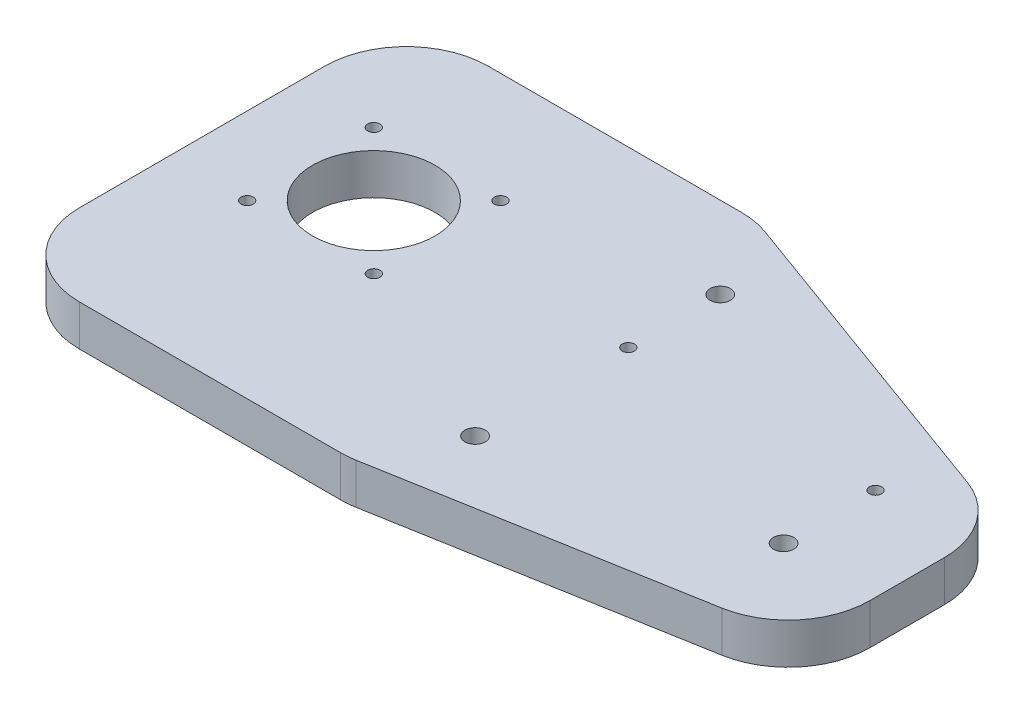
ISO-10303-21;
HEADER;
FILE_DESCRIPTION(('STEP AP214'),'2;1');
FILE_NAME('part.step','',(''),(''),'','','');
FILE_SCHEMA(('AUTOMOTIVE_DESIGN { 1 0 10303 214 1 1 1 1 }'));
ENDSEC;
DATA;
#1=APPLICATION_CONTEXT('core data for automotive mechanical design processes');
#2=APPLICATION_PROTOCOL_DEFINITION('international standard','automotive_design',2000,#1);
#3=PRODUCT_CONTEXT('',#1,'mechanical');
#4=PRODUCT('Part','Part','',(#3));
#5=PRODUCT_RELATED_PRODUCT_CATEGORY('part','',(#4));
#6=PRODUCT_DEFINITION_FORMATION('','',#4);
#7=PRODUCT_DEFINITION_CONTEXT('part definition',#1,'design');
#8=PRODUCT_DEFINITION('design','',#6,#7);
#9=PRODUCT_DEFINITION_SHAPE('','',#8);
#10=(LENGTH_UNIT() NAMED_UNIT(*) SI_UNIT(.MILLI.,.METRE.));
#11=(NAMED_UNIT(*) PLANE_ANGLE_UNIT() SI_UNIT($,.RADIAN.));
#12=(NAMED_UNIT(*) SI_UNIT($,.STERADIAN.) SOLID_ANGLE_UNIT());
#13=UNCERTAINTY_MEASURE_WITH_UNIT(LENGTH_MEASURE(1.E-05),#10,'distance_accuracy_value','');
#14=(GEOMETRIC_REPRESENTATION_CONTEXT(3) GLOBAL_UNCERTAINTY_ASSIGNED_CONTEXT((#13)) GLOBAL_UNIT_ASSIGNED_CONTEXT((#10,
#11,#12)) REPRESENTATION_CONTEXT('',''));
#15=CARTESIAN_POINT('',(0.,0.,0.));
#16=DIRECTION('',(0.,0.,1.));
#17=DIRECTION('',(1.,0.,0.));
#18=AXIS2_PLACEMENT_3D('',#15,#16,#17);
#19=CARTESIAN_POINT('',(20.,10.,-80.));
#20=DIRECTION('',(0.,-1.,0.));
#21=DIRECTION('',(0.,0.,-1.));
#22=AXIS2_PLACEMENT_3D('',#19,#20,#21);
#23=CYLINDRICAL_SURFACE('',#22,20.);
#24=CARTESIAN_POINT('',(20.,0.,-80.));
#25=DIRECTION('',(0.,1.,0.));
#26=DIRECTION('',(0.,0.,1.));
#27=AXIS2_PLACEMENT_3D('',#24,#25,#26);
#28=CIRCLE('',#27,20.);
#29=CARTESIAN_POINT('',(0.,0.,-79.9999999999999));
#30=VERTEX_POINT('',#29);
#31=CARTESIAN_POINT('',(20.0000000000001,0.,-100.));
#32=VERTEX_POINT('',#31);
#33=EDGE_CURVE('E184',#30,#32,#28,.F.);
#34=ORIENTED_EDGE('',*,*,#33,.F.);
#35=DIRECTION('',(0.,-1.,0.));
#36=VECTOR('',#35,1.);
#37=CARTESIAN_POINT('',(0.,10.,-79.9999999999999));
#38=LINE('',#37,#36);
#39=CARTESIAN_POINT('',(0.,10.,-79.9999999999999));
#40=VERTEX_POINT('',#39);
#41=EDGE_CURVE('E11',#40,#30,#38,.T.);
#42=ORIENTED_EDGE('',*,*,#41,.F.);
#43=CARTESIAN_POINT('',(20.,10.,-80.));
#44=DIRECTION('',(0.,1.,0.));
#45=DIRECTION('',(0.,0.,1.));
#46=AXIS2_PLACEMENT_3D('',#43,#44,#45);
#47=CIRCLE('',#46,20.);
#48=CARTESIAN_POINT('',(20.0000000000001,10.,-100.));
#49=VERTEX_POINT('',#48);
#50=EDGE_CURVE('E395',#40,#49,#47,.F.);
#51=ORIENTED_EDGE('',*,*,#50,.T.);
#52=DIRECTION('',(0.,-1.,0.));
#53=VECTOR('',#52,1.);
#54=CARTESIAN_POINT('',(20.0000000000001,10.,-100.));
#55=LINE('',#54,#53);
#56=EDGE_CURVE('E52',#49,#32,#55,.T.);
#57=ORIENTED_EDGE('',*,*,#56,.T.);
#58=EDGE_LOOP('',(#34,#42,#51,#57));
#59=FACE_BOUND('',#58,.T.);
#60=ADVANCED_FACE('F35',(#59),#23,.T.);
#61=CARTESIAN_POINT('',(0.,10.,0.));
#62=DIRECTION('',(-1.,0.,0.));
#63=DIRECTION('',(0.,0.,1.));
#64=AXIS2_PLACEMENT_3D('',#61,#62,#63);
#65=PLANE('',#64);
#66=DIRECTION('',(0.,0.,-1.));
#67=VECTOR('',#66,1.);
#68=CARTESIAN_POINT('',(0.,0.,0.));
#69=LINE('',#68,#67);
#70=CARTESIAN_POINT('',(0.,0.,-20.0000000000001));
#71=VERTEX_POINT('',#70);
#72=EDGE_CURVE('E186',#71,#30,#69,.T.);
#73=ORIENTED_EDGE('',*,*,#72,.F.);
#74=DIRECTION('',(0.,-1.,0.));
#75=VECTOR('',#74,1.);
#76=CARTESIAN_POINT('',(0.,10.,-20.0000000000001));
#77=LINE('',#76,#75);
#78=CARTESIAN_POINT('',(0.,10.,-20.0000000000001));
#79=VERTEX_POINT('',#78);
#80=EDGE_CURVE('E44',#79,#71,#77,.T.);
#81=ORIENTED_EDGE('',*,*,#80,.F.);
#82=DIRECTION('',(0.,0.,-1.));
#83=VECTOR('',#82,1.);
#84=CARTESIAN_POINT('',(0.,10.,0.));
#85=LINE('',#84,#83);
#86=EDGE_CURVE('E270',#79,#40,#85,.T.);
#87=ORIENTED_EDGE('',*,*,#86,.T.);
#88=ORIENTED_EDGE('',*,*,#41,.T.);
#89=EDGE_LOOP('',(#73,#81,#87,#88));
#90=FACE_BOUND('',#89,.T.);
#91=ADVANCED_FACE('F269',(#90),#65,.T.);
#92=CARTESIAN_POINT('',(20.,10.,-20.));
#93=DIRECTION('',(0.,-1.,0.));
#94=DIRECTION('',(0.,0.,-1.));
#95=AXIS2_PLACEMENT_3D('',#92,#93,#94);
#96=CYLINDRICAL_SURFACE('',#95,20.);
#97=CARTESIAN_POINT('',(20.,0.,-20.));
#98=DIRECTION('',(0.,1.,0.));
#99=DIRECTION('',(0.,0.,1.));
#100=AXIS2_PLACEMENT_3D('',#97,#98,#99);
#101=CIRCLE('',#100,20.);
#102=CARTESIAN_POINT('',(20.0000000000001,0.,0.));
#103=VERTEX_POINT('',#102);
#104=EDGE_CURVE('E189',#71,#103,#101,.T.);
#105=ORIENTED_EDGE('',*,*,#104,.T.);
#106=DIRECTION('',(0.,-1.,0.));
#107=VECTOR('',#106,1.);
#108=CARTESIAN_POINT('',(20.0000000000001,10.,0.));
#109=LINE('',#108,#107);
#110=CARTESIAN_POINT('',(20.0000000000001,10.,0.));
#111=VERTEX_POINT('',#110);
#112=EDGE_CURVE('E254',#111,#103,#109,.T.);
#113=ORIENTED_EDGE('',*,*,#112,.F.);
#114=CARTESIAN_POINT('',(20.,10.,-20.));
#115=DIRECTION('',(0.,1.,0.));
#116=DIRECTION('',(0.,0.,1.));
#117=AXIS2_PLACEMENT_3D('',#114,#115,#116);
#118=CIRCLE('',#117,20.);
#119=EDGE_CURVE('E260',#79,#111,#118,.T.);
#120=ORIENTED_EDGE('',*,*,#119,.F.);
#121=ORIENTED_EDGE('',*,*,#80,.T.);
#122=EDGE_LOOP('',(#105,#113,#120,#121));
#123=FACE_BOUND('',#122,.T.);
#124=ADVANCED_FACE('F258',(#123),#96,.T.);
#125=CARTESIAN_POINT('',(0.,10.,0.));
#126=DIRECTION('',(0.,0.,1.));
#127=DIRECTION('',(1.,0.,0.));
#128=AXIS2_PLACEMENT_3D('',#125,#126,#127);
#129=PLANE('',#128);
#130=DIRECTION('',(-1.,0.,0.));
#131=VECTOR('',#130,1.);
#132=CARTESIAN_POINT('',(0.,0.,0.));
#133=LINE('',#132,#131);
#134=CARTESIAN_POINT('',(83.8577357328527,0.,0.));
#135=VERTEX_POINT('',#134);
#136=EDGE_CURVE('E192',#135,#103,#133,.T.);
#137=ORIENTED_EDGE('',*,*,#136,.F.);
#138=DIRECTION('',(0.,-1.,0.));
#139=VECTOR('',#138,1.);
#140=CARTESIAN_POINT('',(83.8577357328527,10.,0.));
#141=LINE('',#140,#139);
#142=CARTESIAN_POINT('',(83.8577357328527,10.,0.));
#143=VERTEX_POINT('',#142);
#144=EDGE_CURVE('E252',#143,#135,#141,.T.);
#145=ORIENTED_EDGE('',*,*,#144,.F.);
#146=DIRECTION('',(-1.,0.,0.));
#147=VECTOR('',#146,1.);
#148=CARTESIAN_POINT('',(0.,10.,0.));
#149=LINE('',#148,#147);
#150=EDGE_CURVE('E401',#143,#111,#149,.T.);
#151=ORIENTED_EDGE('',*,*,#150,.T.);
#152=ORIENTED_EDGE('',*,*,#112,.T.);
#153=EDGE_LOOP('',(#137,#145,#151,#152));
#154=FACE_BOUND('',#153,.T.);
#155=ADVANCED_FACE('F294',(#154),#129,.T.);
#156=CARTESIAN_POINT('',(83.8577357328527,10.,-20.));
#157=DIRECTION('',(0.,-1.,0.));
#158=DIRECTION('',(0.,0.,-1.));
#159=AXIS2_PLACEMENT_3D('',#156,#157,#158);
#160=CYLINDRICAL_SURFACE('',#159,20.);
#161=CARTESIAN_POINT('',(83.8577357328527,0.,-20.));
#162=DIRECTION('',(0.,1.,0.));
#163=DIRECTION('',(0.,0.,1.));
#164=AXIS2_PLACEMENT_3D('',#161,#162,#163);
#165=CIRCLE('',#164,20.);
#166=CARTESIAN_POINT('',(87.3306992861914,0.,-0.303844939755851));
#167=VERTEX_POINT('',#166);
#168=EDGE_CURVE('E195',#167,#135,#165,.F.);
#169=ORIENTED_EDGE('',*,*,#168,.F.);
#170=DIRECTION('',(0.,-1.,0.));
#171=VECTOR('',#170,1.);
#172=CARTESIAN_POINT('',(87.3306992861914,10.,-0.303844939755851));
#173=LINE('',#172,#171);
#174=CARTESIAN_POINT('',(87.3306992861914,10.,-0.303844939755851));
#175=VERTEX_POINT('',#174);
#176=EDGE_CURVE('E250',#175,#167,#173,.T.);
#177=ORIENTED_EDGE('',*,*,#176,.F.);
#178=CARTESIAN_POINT('',(83.8577357328527,10.,-20.));
#179=DIRECTION('',(0.,1.,0.));
#180=DIRECTION('',(0.,0.,1.));
#181=AXIS2_PLACEMENT_3D('',#178,#179,#180);
#182=CIRCLE('',#181,20.);
#183=EDGE_CURVE('E404',#175,#143,#182,.F.);
#184=ORIENTED_EDGE('',*,*,#183,.T.);
#185=ORIENTED_EDGE('',*,*,#144,.T.);
#186=EDGE_LOOP('',(#169,#177,#184,#185));
#187=FACE_BOUND('',#186,.T.);
#188=ADVANCED_FACE('F297',(#187),#160,.T.);
#189=CARTESIAN_POINT('',(2.58138225452005,10.,14.6397462495433));
#190=DIRECTION('',(0.173648177666931,0.,0.984807753012208));
#191=DIRECTION('',(0.984807753012208,0.,-0.173648177666931));
#192=AXIS2_PLACEMENT_3D('',#189,#190,#191);
#193=PLANE('',#192);
#194=DIRECTION('',(-0.984807753012208,0.,0.173648177666931));
#195=VECTOR('',#194,1.);
#196=CARTESIAN_POINT('',(2.58138225452005,0.,14.6397462495433));
#197=LINE('',#196,#195);
#198=CARTESIAN_POINT('',(163.472963553338,0.,-13.729780502288));
#199=VERTEX_POINT('',#198);
#200=EDGE_CURVE('E198',#199,#167,#197,.T.);
#201=ORIENTED_EDGE('',*,*,#200,.F.);
#202=DIRECTION('',(0.,-1.,0.));
#203=VECTOR('',#202,1.);
#204=CARTESIAN_POINT('',(163.472963553338,10.,-13.729780502288));
#205=LINE('',#204,#203);
#206=CARTESIAN_POINT('',(163.472963553338,10.,-13.729780502288));
#207=VERTEX_POINT('',#206);
#208=EDGE_CURVE('E248',#207,#199,#205,.T.);
#209=ORIENTED_EDGE('',*,*,#208,.F.);
#210=DIRECTION('',(-0.984807753012208,0.,0.173648177666931));
#211=VECTOR('',#210,1.);
#212=CARTESIAN_POINT('',(2.58138225452005,10.,14.6397462495433));
#213=LINE('',#212,#211);
#214=EDGE_CURVE('E407',#207,#175,#213,.T.);
#215=ORIENTED_EDGE('',*,*,#214,.T.);
#216=ORIENTED_EDGE('',*,*,#176,.T.);
#217=EDGE_LOOP('',(#201,#209,#215,#216));
#218=FACE_BOUND('',#217,.T.);
#219=ADVANCED_FACE('F301',(#218),#193,.T.);
#220=CARTESIAN_POINT('',(160.,10.,-33.4259355625321));
#221=DIRECTION('',(0.,-1.,0.));
#222=DIRECTION('',(0.,0.,-1.));
#223=AXIS2_PLACEMENT_3D('',#220,#221,#222);
#224=CYLINDRICAL_SURFACE('',#223,20.);
#225=CARTESIAN_POINT('',(160.,0.,-33.4259355625321));
#226=DIRECTION('',(0.,1.,0.));
#227=DIRECTION('',(0.,0.,1.));
#228=AXIS2_PLACEMENT_3D('',#225,#226,#227);
#229=CIRCLE('',#228,20.);
#230=CARTESIAN_POINT('',(180.,0.,-33.4259355625323));
#231=VERTEX_POINT('',#230);
#232=EDGE_CURVE('E201',#231,#199,#229,.F.);
#233=ORIENTED_EDGE('',*,*,#232,.F.);
#234=DIRECTION('',(0.,-1.,0.));
#235=VECTOR('',#234,1.);
#236=CARTESIAN_POINT('',(180.,10.,-33.4259355625323));
#237=LINE('',#236,#235);
#238=CARTESIAN_POINT('',(180.,10.,-33.4259355625323));
#239=VERTEX_POINT('',#238);
#240=EDGE_CURVE('E246',#239,#231,#237,.T.);
#241=ORIENTED_EDGE('',*,*,#240,.F.);
#242=CARTESIAN_POINT('',(160.,10.,-33.4259355625321));
#243=DIRECTION('',(0.,1.,0.));
#244=DIRECTION('',(0.,0.,1.));
#245=AXIS2_PLACEMENT_3D('',#242,#243,#244);
#246=CIRCLE('',#245,20.);
#247=EDGE_CURVE('E410',#239,#207,#246,.F.);
#248=ORIENTED_EDGE('',*,*,#247,.T.);
#249=ORIENTED_EDGE('',*,*,#208,.T.);
#250=EDGE_LOOP('',(#233,#241,#248,#249));
#251=FACE_BOUND('',#250,.T.);
#252=ADVANCED_FACE('F305',(#251),#224,.T.);
#253=CARTESIAN_POINT('',(180.,10.,0.));
#254=DIRECTION('',(1.,0.,0.));
#255=DIRECTION('',(0.,0.,-1.));
#256=AXIS2_PLACEMENT_3D('',#253,#254,#255);
#257=PLANE('',#256);
#258=DIRECTION('',(0.,0.,1.));
#259=VECTOR('',#258,1.);
#260=CARTESIAN_POINT('',(180.,0.,0.));
#261=LINE('',#260,#259);
#262=CARTESIAN_POINT('',(180.,0.,-51.6397921747923));
#263=VERTEX_POINT('',#262);
#264=EDGE_CURVE('E204',#263,#231,#261,.T.);
#265=ORIENTED_EDGE('',*,*,#264,.F.);
#266=DIRECTION('',(0.,-1.,0.));
#267=VECTOR('',#266,1.);
#268=CARTESIAN_POINT('',(180.,10.,-51.6397921747923));
#269=LINE('',#268,#267);
#270=CARTESIAN_POINT('',(180.,10.,-51.6397921747923));
#271=VERTEX_POINT('',#270);
#272=EDGE_CURVE('E244',#271,#263,#269,.T.);
#273=ORIENTED_EDGE('',*,*,#272,.F.);
#274=DIRECTION('',(0.,0.,1.));
#275=VECTOR('',#274,1.);
#276=CARTESIAN_POINT('',(180.,10.,0.));
#277=LINE('',#276,#275);
#278=EDGE_CURVE('E413',#271,#239,#277,.T.);
#279=ORIENTED_EDGE('',*,*,#278,.T.);
#280=ORIENTED_EDGE('',*,*,#240,.T.);
#281=EDGE_LOOP('',(#265,#273,#279,#280));
#282=FACE_BOUND('',#281,.T.);
#283=ADVANCED_FACE('F309',(#282),#257,.T.);
#284=CARTESIAN_POINT('',(160.,10.,-51.6397921747924));
#285=DIRECTION('',(0.,-1.,0.));
#286=DIRECTION('',(0.,0.,-1.));
#287=AXIS2_PLACEMENT_3D('',#284,#285,#286);
#288=CYLINDRICAL_SURFACE('',#287,20.);
#289=CARTESIAN_POINT('',(160.,0.,-51.6397921747924));
#290=DIRECTION('',(0.,1.,0.));
#291=DIRECTION('',(0.,0.,1.));
#292=AXIS2_PLACEMENT_3D('',#289,#290,#291);
#293=CIRCLE('',#292,20.);
#294=CARTESIAN_POINT('',(166.840402866513,0.,-70.4336445905106));
#295=VERTEX_POINT('',#294);
#296=EDGE_CURVE('E207',#295,#263,#293,.F.);
#297=ORIENTED_EDGE('',*,*,#296,.F.);
#298=DIRECTION('',(0.,-1.,0.));
#299=VECTOR('',#298,1.);
#300=CARTESIAN_POINT('',(166.840402866513,10.,-70.4336445905106));
#301=LINE('',#300,#299);
#302=CARTESIAN_POINT('',(166.840402866513,10.,-70.4336445905106));
#303=VERTEX_POINT('',#302);
#304=EDGE_CURVE('E135',#303,#295,#301,.T.);
#305=ORIENTED_EDGE('',*,*,#304,.F.);
#306=CARTESIAN_POINT('',(160.,10.,-51.6397921747924));
#307=DIRECTION('',(0.,1.,0.));
#308=DIRECTION('',(0.,0.,1.));
#309=AXIS2_PLACEMENT_3D('',#306,#307,#308);
#310=CIRCLE('',#309,20.);
#311=EDGE_CURVE('E146',#303,#271,#310,.F.);
#312=ORIENTED_EDGE('',*,*,#311,.T.);
#313=ORIENTED_EDGE('',*,*,#272,.T.);
#314=EDGE_LOOP('',(#297,#305,#312,#313));
#315=FACE_BOUND('',#314,.T.);
#316=ADVANCED_FACE('F313',(#315),#288,.T.);
#317=CARTESIAN_POINT('',(42.1535567053675,10.,-115.815945197697));
#318=DIRECTION('',(0.34202014332567,0.,-0.939692620785908));
#319=DIRECTION('',(-0.939692620785908,0.,-0.34202014332567));
#320=AXIS2_PLACEMENT_3D('',#317,#318,#319);
#321=PLANE('',#320);
#322=DIRECTION('',(0.939692620785908,0.,0.34202014332567));
#323=VECTOR('',#322,1.);
#324=CARTESIAN_POINT('',(42.1535567053675,0.,-115.815945197697));
#325=LINE('',#324,#323);
#326=CARTESIAN_POINT('',(88.9213722557154,0.,-98.7938524157181));
#327=VERTEX_POINT('',#326);
#328=EDGE_CURVE('E131',#327,#295,#325,.T.);
#329=ORIENTED_EDGE('',*,*,#328,.F.);
#330=DIRECTION('',(0.,-1.,0.));
#331=VECTOR('',#330,1.);
#332=CARTESIAN_POINT('',(88.9213722557154,10.,-98.7938524157181));
#333=LINE('',#332,#331);
#334=CARTESIAN_POINT('',(88.9213722557154,10.,-98.7938524157181));
#335=VERTEX_POINT('',#334);
#336=EDGE_CURVE('E126',#335,#327,#333,.T.);
#337=ORIENTED_EDGE('',*,*,#336,.F.);
#338=DIRECTION('',(0.939692620785908,0.,0.34202014332567));
#339=VECTOR('',#338,1.);
#340=CARTESIAN_POINT('',(42.1535567053675,10.,-115.815945197697));
#341=LINE('',#340,#339);
#342=EDGE_CURVE('E129',#335,#303,#341,.T.);
#343=ORIENTED_EDGE('',*,*,#342,.T.);
#344=ORIENTED_EDGE('',*,*,#304,.T.);
#345=EDGE_LOOP('',(#329,#337,#343,#344));
#346=FACE_BOUND('',#345,.T.);
#347=ADVANCED_FACE('F128',(#346),#321,.T.);
#348=CARTESIAN_POINT('',(82.0809693892019,10.,-80.));
#349=DIRECTION('',(0.,-1.,0.));
#350=DIRECTION('',(0.,0.,-1.));
#351=AXIS2_PLACEMENT_3D('',#348,#349,#350);
#352=CYLINDRICAL_SURFACE('',#351,20.);
#353=CARTESIAN_POINT('',(82.0809693892019,0.,-80.));
#354=DIRECTION('',(0.,1.,0.));
#355=DIRECTION('',(0.,0.,1.));
#356=AXIS2_PLACEMENT_3D('',#353,#354,#355);
#357=CIRCLE('',#356,20.);
#358=CARTESIAN_POINT('',(82.0809693892018,0.,-100.));
#359=VERTEX_POINT('',#358);
#360=EDGE_CURVE('E211',#359,#327,#357,.F.);
#361=ORIENTED_EDGE('',*,*,#360,.F.);
#362=DIRECTION('',(0.,-1.,0.));
#363=VECTOR('',#362,1.);
#364=CARTESIAN_POINT('',(82.0809693892018,10.,-100.));
#365=LINE('',#364,#363);
#366=CARTESIAN_POINT('',(82.0809693892018,10.,-100.));
#367=VERTEX_POINT('',#366);
#368=EDGE_CURVE('E89',#367,#359,#365,.T.);
#369=ORIENTED_EDGE('',*,*,#368,.F.);
#370=CARTESIAN_POINT('',(82.0809693892019,10.,-80.));
#371=DIRECTION('',(0.,1.,0.));
#372=DIRECTION('',(0.,0.,1.));
#373=AXIS2_PLACEMENT_3D('',#370,#371,#372);
#374=CIRCLE('',#373,20.);
#375=EDGE_CURVE('E143',#367,#335,#374,.F.);
#376=ORIENTED_EDGE('',*,*,#375,.T.);
#377=ORIENTED_EDGE('',*,*,#336,.T.);
#378=EDGE_LOOP('',(#361,#369,#376,#377));
#379=FACE_BOUND('',#378,.T.);
#380=ADVANCED_FACE('F148',(#379),#352,.T.);
#381=CARTESIAN_POINT('',(34.5,10.,-57.5));
#382=DIRECTION('',(0.,-1.,0.));
#383=DIRECTION('',(0.,0.,-1.));
#384=AXIS2_PLACEMENT_3D('',#381,#382,#383);
#385=CYLINDRICAL_SURFACE('',#384,15.);
#386=CARTESIAN_POINT('',(34.5,10.,-57.5));
#387=DIRECTION('',(0.,1.,0.));
#388=DIRECTION('',(0.,0.,1.));
#389=AXIS2_PLACEMENT_3D('',#386,#387,#388);
#390=CIRCLE('',#389,15.);
#391=CARTESIAN_POINT('',(34.5,10.,-42.5));
#392=VERTEX_POINT('',#391);
#393=EDGE_CURVE('E172',#392,#392,#390,.T.);
#394=ORIENTED_EDGE('',*,*,#393,.T.);
#395=EDGE_LOOP('',(#394));
#396=FACE_BOUND('',#395,.T.);
#397=CARTESIAN_POINT('',(34.5,0.,-57.5));
#398=DIRECTION('',(0.,1.,0.));
#399=DIRECTION('',(0.,0.,1.));
#400=AXIS2_PLACEMENT_3D('',#397,#398,#399);
#401=CIRCLE('',#400,15.);
#402=CARTESIAN_POINT('',(34.5,0.,-42.5));
#403=VERTEX_POINT('',#402);
#404=EDGE_CURVE('E234',#403,#403,#401,.T.);
#405=ORIENTED_EDGE('',*,*,#404,.F.);
#406=EDGE_LOOP('',(#405));
#407=FACE_BOUND('',#406,.T.);
#408=ADVANCED_FACE('F320',(#396,#407),#385,.F.);
#409=CARTESIAN_POINT('',(19.,10.,-73.));
#410=DIRECTION('',(0.,-1.,0.));
#411=DIRECTION('',(0.,0.,-1.));
#412=AXIS2_PLACEMENT_3D('',#409,#410,#411);
#413=CYLINDRICAL_SURFACE('',#412,1.5);
#414=CARTESIAN_POINT('',(19.,10.,-73.));
#415=DIRECTION('',(0.,1.,0.));
#416=DIRECTION('',(0.,0.,1.));
#417=AXIS2_PLACEMENT_3D('',#414,#415,#416);
#418=CIRCLE('',#417,1.5);
#419=CARTESIAN_POINT('',(19.,10.,-71.5));
#420=VERTEX_POINT('',#419);
#421=EDGE_CURVE('E169',#420,#420,#418,.T.);
#422=ORIENTED_EDGE('',*,*,#421,.T.);
#423=EDGE_LOOP('',(#422));
#424=FACE_BOUND('',#423,.T.);
#425=CARTESIAN_POINT('',(19.,0.,-73.));
#426=DIRECTION('',(0.,1.,0.));
#427=DIRECTION('',(0.,0.,1.));
#428=AXIS2_PLACEMENT_3D('',#425,#426,#427);
#429=CIRCLE('',#428,1.5);
#430=CARTESIAN_POINT('',(19.,0.,-71.5));
#431=VERTEX_POINT('',#430);
#432=EDGE_CURVE('E231',#431,#431,#429,.T.);
#433=ORIENTED_EDGE('',*,*,#432,.F.);
#434=EDGE_LOOP('',(#433));
#435=FACE_BOUND('',#434,.T.);
#436=ADVANCED_FACE('F324',(#424,#435),#413,.F.);
#437=CARTESIAN_POINT('',(50.,10.,-73.));
#438=DIRECTION('',(0.,-1.,0.));
#439=DIRECTION('',(0.,0.,-1.));
#440=AXIS2_PLACEMENT_3D('',#437,#438,#439);
#441=CYLINDRICAL_SURFACE('',#440,1.5);
#442=CARTESIAN_POINT('',(50.,10.,-73.));
#443=DIRECTION('',(0.,1.,0.));
#444=DIRECTION('',(0.,0.,1.));
#445=AXIS2_PLACEMENT_3D('',#442,#443,#444);
#446=CIRCLE('',#445,1.5);
#447=CARTESIAN_POINT('',(50.,10.,-71.5));
#448=VERTEX_POINT('',#447);
#449=EDGE_CURVE('E166',#448,#448,#446,.F.);
#450=ORIENTED_EDGE('',*,*,#449,.F.);
#451=EDGE_LOOP('',(#450));
#452=FACE_BOUND('',#451,.T.);
#453=CARTESIAN_POINT('',(50.,0.,-73.));
#454=DIRECTION('',(0.,1.,0.));
#455=DIRECTION('',(0.,0.,1.));
#456=AXIS2_PLACEMENT_3D('',#453,#454,#455);
#457=CIRCLE('',#456,1.5);
#458=CARTESIAN_POINT('',(50.,0.,-71.5));
#459=VERTEX_POINT('',#458);
#460=EDGE_CURVE('E228',#459,#459,#457,.F.);
#461=ORIENTED_EDGE('',*,*,#460,.T.);
#462=EDGE_LOOP('',(#461));
#463=FACE_BOUND('',#462,.T.);
#464=ADVANCED_FACE('F330',(#452,#463),#441,.F.);
#465=CARTESIAN_POINT('',(50.,10.,-42.));
#466=DIRECTION('',(0.,-1.,0.));
#467=DIRECTION('',(0.,0.,-1.));
#468=AXIS2_PLACEMENT_3D('',#465,#466,#467);
#469=CYLINDRICAL_SURFACE('',#468,1.5);
#470=CARTESIAN_POINT('',(50.,10.,-42.));
#471=DIRECTION('',(0.,1.,0.));
#472=DIRECTION('',(0.,0.,1.));
#473=AXIS2_PLACEMENT_3D('',#470,#471,#472);
#474=CIRCLE('',#473,1.5);
#475=CARTESIAN_POINT('',(50.,10.,-40.5));
#476=VERTEX_POINT('',#475);
#477=EDGE_CURVE('E163',#476,#476,#474,.T.);
#478=ORIENTED_EDGE('',*,*,#477,.T.);
#479=EDGE_LOOP('',(#478));
#480=FACE_BOUND('',#479,.T.);
#481=CARTESIAN_POINT('',(50.,0.,-42.));
#482=DIRECTION('',(0.,1.,0.));
#483=DIRECTION('',(0.,0.,1.));
#484=AXIS2_PLACEMENT_3D('',#481,#482,#483);
#485=CIRCLE('',#484,1.5);
#486=CARTESIAN_POINT('',(50.,0.,-40.5));
#487=VERTEX_POINT('',#486);
#488=EDGE_CURVE('E225',#487,#487,#485,.T.);
#489=ORIENTED_EDGE('',*,*,#488,.F.);
#490=EDGE_LOOP('',(#489));
#491=FACE_BOUND('',#490,.T.);
#492=ADVANCED_FACE('F340',(#480,#491),#469,.F.);
#493=CARTESIAN_POINT('',(96.8,10.,-80.));
#494=DIRECTION('',(0.,-1.,0.));
#495=DIRECTION('',(0.,0.,-1.));
#496=AXIS2_PLACEMENT_3D('',#493,#494,#495);
#497=CYLINDRICAL_SURFACE('',#496,2.5);
#498=CARTESIAN_POINT('',(96.8,10.,-80.));
#499=DIRECTION('',(0.,1.,0.));
#500=DIRECTION('',(0.,0.,1.));
#501=AXIS2_PLACEMENT_3D('',#498,#499,#500);
#502=CIRCLE('',#501,2.5);
#503=CARTESIAN_POINT('',(96.8,10.,-77.5));
#504=VERTEX_POINT('',#503);
#505=EDGE_CURVE('E160',#504,#504,#502,.T.);
#506=ORIENTED_EDGE('',*,*,#505,.T.);
#507=EDGE_LOOP('',(#506));
#508=FACE_BOUND('',#507,.T.);
#509=CARTESIAN_POINT('',(96.8,0.,-80.));
#510=DIRECTION('',(0.,1.,0.));
#511=DIRECTION('',(0.,0.,1.));
#512=AXIS2_PLACEMENT_3D('',#509,#510,#511);
#513=CIRCLE('',#512,2.5);
#514=CARTESIAN_POINT('',(96.8,0.,-77.5));
#515=VERTEX_POINT('',#514);
#516=EDGE_CURVE('E222',#515,#515,#513,.T.);
#517=ORIENTED_EDGE('',*,*,#516,.F.);
#518=EDGE_LOOP('',(#517));
#519=FACE_BOUND('',#518,.T.);
#520=ADVANCED_FACE('F344',(#508,#519),#497,.F.);
#521=CARTESIAN_POINT('',(96.8,10.,-20.));
#522=DIRECTION('',(0.,-1.,0.));
#523=DIRECTION('',(0.,0.,-1.));
#524=AXIS2_PLACEMENT_3D('',#521,#522,#523);
#525=CYLINDRICAL_SURFACE('',#524,2.5);
#526=CARTESIAN_POINT('',(96.8,10.,-20.));
#527=DIRECTION('',(0.,1.,0.));
#528=DIRECTION('',(0.,0.,1.));
#529=AXIS2_PLACEMENT_3D('',#526,#527,#528);
#530=CIRCLE('',#529,2.5);
#531=CARTESIAN_POINT('',(96.8,10.,-17.5));
#532=VERTEX_POINT('',#531);
#533=EDGE_CURVE('E157',#532,#532,#530,.T.);
#534=ORIENTED_EDGE('',*,*,#533,.T.);
#535=EDGE_LOOP('',(#534));
#536=FACE_BOUND('',#535,.T.);
#537=CARTESIAN_POINT('',(96.8,0.,-20.));
#538=DIRECTION('',(0.,1.,0.));
#539=DIRECTION('',(0.,0.,1.));
#540=AXIS2_PLACEMENT_3D('',#537,#538,#539);
#541=CIRCLE('',#540,2.5);
#542=CARTESIAN_POINT('',(96.8,0.,-17.5));
#543=VERTEX_POINT('',#542);
#544=EDGE_CURVE('E219',#543,#543,#541,.T.);
#545=ORIENTED_EDGE('',*,*,#544,.F.);
#546=EDGE_LOOP('',(#545));
#547=FACE_BOUND('',#546,.T.);
#548=ADVANCED_FACE('F281',(#536,#547),#525,.F.);
#549=CARTESIAN_POINT('',(157.3,10.,-35.));
#550=DIRECTION('',(0.,-1.,0.));
#551=DIRECTION('',(0.,0.,-1.));
#552=AXIS2_PLACEMENT_3D('',#549,#550,#551);
#553=CYLINDRICAL_SURFACE('',#552,2.5);
#554=CARTESIAN_POINT('',(157.3,10.,-35.));
#555=DIRECTION('',(0.,1.,0.));
#556=DIRECTION('',(0.,0.,1.));
#557=AXIS2_PLACEMENT_3D('',#554,#555,#556);
#558=CIRCLE('',#557,2.5);
#559=CARTESIAN_POINT('',(157.3,10.,-32.5));
#560=VERTEX_POINT('',#559);
#561=EDGE_CURVE('E151',#560,#560,#558,.T.);
#562=ORIENTED_EDGE('',*,*,#561,.T.);
#563=EDGE_LOOP('',(#562));
#564=FACE_BOUND('',#563,.T.);
#565=CARTESIAN_POINT('',(157.3,0.,-35.));
#566=DIRECTION('',(0.,1.,0.));
#567=DIRECTION('',(0.,0.,1.));
#568=AXIS2_PLACEMENT_3D('',#565,#566,#567);
#569=CIRCLE('',#568,2.5);
#570=CARTESIAN_POINT('',(157.3,0.,-32.5));
#571=VERTEX_POINT('',#570);
#572=EDGE_CURVE('E216',#571,#571,#569,.T.);
#573=ORIENTED_EDGE('',*,*,#572,.F.);
#574=EDGE_LOOP('',(#573));
#575=FACE_BOUND('',#574,.T.);
#576=ADVANCED_FACE('F274',(#564,#575),#553,.F.);
#577=CARTESIAN_POINT('',(0.,10.,-100.));
#578=DIRECTION('',(0.,0.,-1.));
#579=DIRECTION('',(-1.,0.,0.));
#580=AXIS2_PLACEMENT_3D('',#577,#578,#579);
#581=PLANE('',#580);
#582=DIRECTION('',(1.,0.,0.));
#583=VECTOR('',#582,1.);
#584=CARTESIAN_POINT('',(0.,0.,-100.));
#585=LINE('',#584,#583);
#586=EDGE_CURVE('E213',#32,#359,#585,.T.);
#587=ORIENTED_EDGE('',*,*,#586,.F.);
#588=ORIENTED_EDGE('',*,*,#56,.F.);
#589=DIRECTION('',(1.,0.,0.));
#590=VECTOR('',#589,1.);
#591=CARTESIAN_POINT('',(0.,10.,-100.));
#592=LINE('',#591,#590);
#593=EDGE_CURVE('E149',#49,#367,#592,.T.);
#594=ORIENTED_EDGE('',*,*,#593,.T.);
#595=ORIENTED_EDGE('',*,*,#368,.T.);
#596=EDGE_LOOP('',(#587,#588,#594,#595));
#597=FACE_BOUND('',#596,.T.);
#598=ADVANCED_FACE('F271',(#597),#581,.T.);
#599=CARTESIAN_POINT('',(96.8,10.,-57.5));
#600=DIRECTION('',(0.,-1.,0.));
#601=DIRECTION('',(0.,0.,-1.));
#602=AXIS2_PLACEMENT_3D('',#599,#600,#601);
#603=CYLINDRICAL_SURFACE('',#602,1.5);
#604=CARTESIAN_POINT('',(96.8,10.,-57.5));
#605=DIRECTION('',(0.,1.,0.));
#606=DIRECTION('',(0.,0.,1.));
#607=AXIS2_PLACEMENT_3D('',#604,#605,#606);
#608=CIRCLE('',#607,1.5);
#609=CARTESIAN_POINT('',(96.8,10.,-56.));
#610=VERTEX_POINT('',#609);
#611=EDGE_CURVE('E392',#610,#610,#608,.T.);
#612=ORIENTED_EDGE('',*,*,#611,.T.);
#613=EDGE_LOOP('',(#612));
#614=FACE_BOUND('',#613,.T.);
#615=CARTESIAN_POINT('',(96.8,0.,-57.5));
#616=DIRECTION('',(0.,1.,0.));
#617=DIRECTION('',(0.,0.,1.));
#618=AXIS2_PLACEMENT_3D('',#615,#616,#617);
#619=CIRCLE('',#618,1.5);
#620=CARTESIAN_POINT('',(96.8,0.,-56.));
#621=VERTEX_POINT('',#620);
#622=EDGE_CURVE('E181',#621,#621,#619,.T.);
#623=ORIENTED_EDGE('',*,*,#622,.F.);
#624=EDGE_LOOP('',(#623));
#625=FACE_BOUND('',#624,.T.);
#626=ADVANCED_FACE('F273',(#614,#625),#603,.F.);
#627=CARTESIAN_POINT('',(157.3,10.,-57.5));
#628=DIRECTION('',(0.,-1.,0.));
#629=DIRECTION('',(0.,0.,-1.));
#630=AXIS2_PLACEMENT_3D('',#627,#628,#629);
#631=CYLINDRICAL_SURFACE('',#630,1.5);
#632=CARTESIAN_POINT('',(157.3,10.,-57.5));
#633=DIRECTION('',(0.,1.,0.));
#634=DIRECTION('',(0.,0.,1.));
#635=AXIS2_PLACEMENT_3D('',#632,#633,#634);
#636=CIRCLE('',#635,1.5);
#637=CARTESIAN_POINT('',(157.3,10.,-56.));
#638=VERTEX_POINT('',#637);
#639=EDGE_CURVE('E240',#638,#638,#636,.T.);
#640=ORIENTED_EDGE('',*,*,#639,.T.);
#641=EDGE_LOOP('',(#640));
#642=FACE_BOUND('',#641,.T.);
#643=CARTESIAN_POINT('',(157.3,0.,-57.5));
#644=DIRECTION('',(0.,1.,0.));
#645=DIRECTION('',(0.,0.,1.));
#646=AXIS2_PLACEMENT_3D('',#643,#644,#645);
#647=CIRCLE('',#646,1.5);
#648=CARTESIAN_POINT('',(157.3,0.,-56.));
#649=VERTEX_POINT('',#648);
#650=EDGE_CURVE('E178',#649,#649,#647,.T.);
#651=ORIENTED_EDGE('',*,*,#650,.F.);
#652=EDGE_LOOP('',(#651));
#653=FACE_BOUND('',#652,.T.);
#654=ADVANCED_FACE('F37',(#642,#653),#631,.F.);
#655=CARTESIAN_POINT('',(19.,10.,-42.));
#656=DIRECTION('',(0.,-1.,0.));
#657=DIRECTION('',(0.,0.,-1.));
#658=AXIS2_PLACEMENT_3D('',#655,#656,#657);
#659=CYLINDRICAL_SURFACE('',#658,1.5);
#660=CARTESIAN_POINT('',(19.,10.,-42.));
#661=DIRECTION('',(0.,1.,0.));
#662=DIRECTION('',(0.,0.,1.));
#663=AXIS2_PLACEMENT_3D('',#660,#661,#662);
#664=CIRCLE('',#663,1.5);
#665=CARTESIAN_POINT('',(19.,10.,-40.5));
#666=VERTEX_POINT('',#665);
#667=EDGE_CURVE('E175',#666,#666,#664,.F.);
#668=ORIENTED_EDGE('',*,*,#667,.F.);
#669=EDGE_LOOP('',(#668));
#670=FACE_BOUND('',#669,.T.);
#671=CARTESIAN_POINT('',(19.,0.,-42.));
#672=DIRECTION('',(0.,1.,0.));
#673=DIRECTION('',(0.,0.,1.));
#674=AXIS2_PLACEMENT_3D('',#671,#672,#673);
#675=CIRCLE('',#674,1.5);
#676=CARTESIAN_POINT('',(19.,0.,-40.5));
#677=VERTEX_POINT('',#676);
#678=EDGE_CURVE('E237',#677,#677,#675,.F.);
#679=ORIENTED_EDGE('',*,*,#678,.T.);
#680=EDGE_LOOP('',(#679));
#681=FACE_BOUND('',#680,.T.);
#682=ADVANCED_FACE('F335',(#670,#681),#659,.F.);
#683=CARTESIAN_POINT('',(0.,10.,0.));
#684=DIRECTION('',(0.,1.,0.));
#685=DIRECTION('',(0.,0.,1.));
#686=AXIS2_PLACEMENT_3D('',#683,#684,#685);
#687=PLANE('',#686);
#688=ORIENTED_EDGE('',*,*,#639,.F.);
#689=EDGE_LOOP('',(#688));
#690=FACE_BOUND('',#689,.T.);
#691=ORIENTED_EDGE('',*,*,#611,.F.);
#692=EDGE_LOOP('',(#691));
#693=FACE_BOUND('',#692,.T.);
#694=ORIENTED_EDGE('',*,*,#50,.F.);
#695=ORIENTED_EDGE('',*,*,#86,.F.);
#696=ORIENTED_EDGE('',*,*,#119,.T.);
#697=ORIENTED_EDGE('',*,*,#150,.F.);
#698=ORIENTED_EDGE('',*,*,#183,.F.);
#699=ORIENTED_EDGE('',*,*,#214,.F.);
#700=ORIENTED_EDGE('',*,*,#247,.F.);
#701=ORIENTED_EDGE('',*,*,#278,.F.);
#702=ORIENTED_EDGE('',*,*,#311,.F.);
#703=ORIENTED_EDGE('',*,*,#342,.F.);
#704=ORIENTED_EDGE('',*,*,#375,.F.);
#705=ORIENTED_EDGE('',*,*,#593,.F.);
#706=EDGE_LOOP('',(#694,#695,#696,#697,#698,#699,#700,#701,#702,#703,#704,#705));
#707=FACE_BOUND('',#706,.T.);
#708=ORIENTED_EDGE('',*,*,#561,.F.);
#709=EDGE_LOOP('',(#708));
#710=FACE_BOUND('',#709,.T.);
#711=ORIENTED_EDGE('',*,*,#533,.F.);
#712=EDGE_LOOP('',(#711));
#713=FACE_BOUND('',#712,.T.);
#714=ORIENTED_EDGE('',*,*,#505,.F.);
#715=EDGE_LOOP('',(#714));
#716=FACE_BOUND('',#715,.T.);
#717=ORIENTED_EDGE('',*,*,#477,.F.);
#718=EDGE_LOOP('',(#717));
#719=FACE_BOUND('',#718,.T.);
#720=ORIENTED_EDGE('',*,*,#449,.T.);
#721=EDGE_LOOP('',(#720));
#722=FACE_BOUND('',#721,.T.);
#723=ORIENTED_EDGE('',*,*,#421,.F.);
#724=EDGE_LOOP('',(#723));
#725=FACE_BOUND('',#724,.T.);
#726=ORIENTED_EDGE('',*,*,#393,.F.);
#727=EDGE_LOOP('',(#726));
#728=FACE_BOUND('',#727,.T.);
#729=ORIENTED_EDGE('',*,*,#667,.T.);
#730=EDGE_LOOP('',(#729));
#731=FACE_BOUND('',#730,.T.);
#732=ADVANCED_FACE('F140',(#690,#693,#707,#710,#713,#716,#719,#722,#725,#728,#731),#687,.T.);
#733=CARTESIAN_POINT('',(0.,0.,0.));
#734=DIRECTION('',(0.,1.,0.));
#735=DIRECTION('',(0.,0.,1.));
#736=AXIS2_PLACEMENT_3D('',#733,#734,#735);
#737=PLANE('',#736);
#738=ORIENTED_EDGE('',*,*,#650,.T.);
#739=EDGE_LOOP('',(#738));
#740=FACE_BOUND('',#739,.T.);
#741=ORIENTED_EDGE('',*,*,#622,.T.);
#742=EDGE_LOOP('',(#741));
#743=FACE_BOUND('',#742,.T.);
#744=ORIENTED_EDGE('',*,*,#33,.T.);
#745=ORIENTED_EDGE('',*,*,#586,.T.);
#746=ORIENTED_EDGE('',*,*,#360,.T.);
#747=ORIENTED_EDGE('',*,*,#328,.T.);
#748=ORIENTED_EDGE('',*,*,#296,.T.);
#749=ORIENTED_EDGE('',*,*,#264,.T.);
#750=ORIENTED_EDGE('',*,*,#232,.T.);
#751=ORIENTED_EDGE('',*,*,#200,.T.);
#752=ORIENTED_EDGE('',*,*,#168,.T.);
#753=ORIENTED_EDGE('',*,*,#136,.T.);
#754=ORIENTED_EDGE('',*,*,#104,.F.);
#755=ORIENTED_EDGE('',*,*,#72,.T.);
#756=EDGE_LOOP('',(#744,#745,#746,#747,#748,#749,#750,#751,#752,#753,#754,#755));
#757=FACE_BOUND('',#756,.T.);
#758=ORIENTED_EDGE('',*,*,#572,.T.);
#759=EDGE_LOOP('',(#758));
#760=FACE_BOUND('',#759,.T.);
#761=ORIENTED_EDGE('',*,*,#544,.T.);
#762=EDGE_LOOP('',(#761));
#763=FACE_BOUND('',#762,.T.);
#764=ORIENTED_EDGE('',*,*,#516,.T.);
#765=EDGE_LOOP('',(#764));
#766=FACE_BOUND('',#765,.T.);
#767=ORIENTED_EDGE('',*,*,#488,.T.);
#768=EDGE_LOOP('',(#767));
#769=FACE_BOUND('',#768,.T.);
#770=ORIENTED_EDGE('',*,*,#460,.F.);
#771=EDGE_LOOP('',(#770));
#772=FACE_BOUND('',#771,.T.);
#773=ORIENTED_EDGE('',*,*,#432,.T.);
#774=EDGE_LOOP('',(#773));
#775=FACE_BOUND('',#774,.T.);
#776=ORIENTED_EDGE('',*,*,#404,.T.);
#777=EDGE_LOOP('',(#776));
#778=FACE_BOUND('',#777,.T.);
#779=ORIENTED_EDGE('',*,*,#678,.F.);
#780=EDGE_LOOP('',(#779));
#781=FACE_BOUND('',#780,.T.);
#782=ADVANCED_FACE('F266',(#740,#743,#757,#760,#763,#766,#769,#772,#775,#778,#781),#737,.F.);
#783=CLOSED_SHELL('',(#60,#91,#124,#155,#188,#219,#252,#283,#316,#347,#380,#408,#436,#464,#492,
#520,#548,#576,#598,#626,#654,#682,#732,#782));
#784=MANIFOLD_SOLID_BREP('B2',#783);
#785=ADVANCED_BREP_SHAPE_REPRESENTATION('',(#18,#784),#14);
#786=SHAPE_DEFINITION_REPRESENTATION(#9,#785);
ENDSEC;
END-ISO-10303-21;
